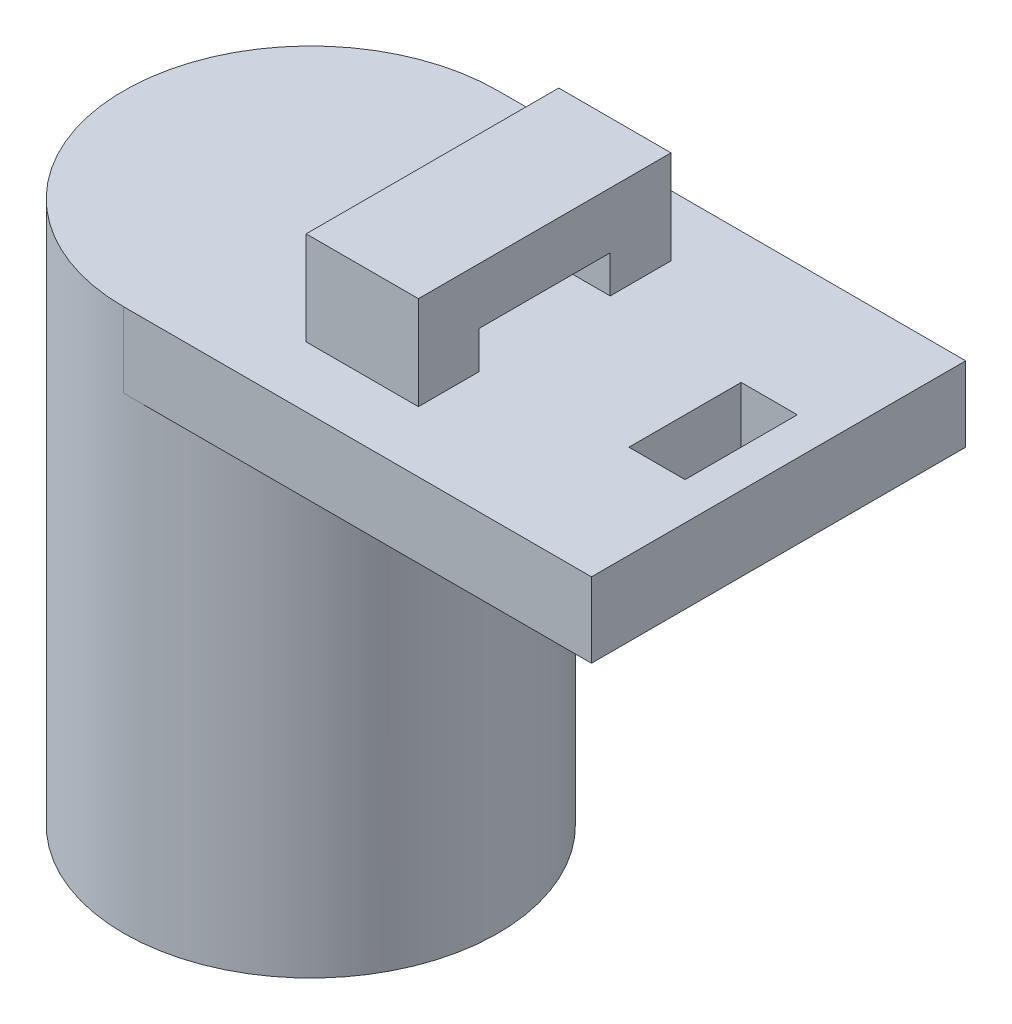
ISO-10303-21;
HEADER;
FILE_DESCRIPTION(('STEP AP214'),'2;1');
FILE_NAME('part.step','',(''),(''),'','','');
FILE_SCHEMA(('AUTOMOTIVE_DESIGN { 1 0 10303 214 1 1 1 1 }'));
ENDSEC;
DATA;
#1=APPLICATION_CONTEXT('core data for automotive mechanical design processes');
#2=APPLICATION_PROTOCOL_DEFINITION('international standard','automotive_design',2000,#1);
#3=PRODUCT_CONTEXT('',#1,'mechanical');
#4=PRODUCT('Part','Part','',(#3));
#5=PRODUCT_RELATED_PRODUCT_CATEGORY('part','',(#4));
#6=PRODUCT_DEFINITION_FORMATION('','',#4);
#7=PRODUCT_DEFINITION_CONTEXT('part definition',#1,'design');
#8=PRODUCT_DEFINITION('design','',#6,#7);
#9=PRODUCT_DEFINITION_SHAPE('','',#8);
#10=(LENGTH_UNIT() NAMED_UNIT(*) SI_UNIT(.MILLI.,.METRE.));
#11=(NAMED_UNIT(*) PLANE_ANGLE_UNIT() SI_UNIT($,.RADIAN.));
#12=(NAMED_UNIT(*) SI_UNIT($,.STERADIAN.) SOLID_ANGLE_UNIT());
#13=UNCERTAINTY_MEASURE_WITH_UNIT(LENGTH_MEASURE(1.E-05),#10,'distance_accuracy_value','');
#14=(GEOMETRIC_REPRESENTATION_CONTEXT(3) GLOBAL_UNCERTAINTY_ASSIGNED_CONTEXT((#13)) GLOBAL_UNIT_ASSIGNED_CONTEXT((#10,
#11,#12)) REPRESENTATION_CONTEXT('',''));
#15=CARTESIAN_POINT('',(0.,0.,0.));
#16=DIRECTION('',(0.,0.,1.));
#17=DIRECTION('',(1.,0.,0.));
#18=AXIS2_PLACEMENT_3D('',#15,#16,#17);
#19=CARTESIAN_POINT('',(0.,29.,0.));
#20=DIRECTION('',(0.,1.,0.));
#21=DIRECTION('',(0.,0.,1.));
#22=AXIS2_PLACEMENT_3D('',#19,#20,#21);
#23=PLANE('',#22);
#24=DIRECTION('',(0.,0.,1.));
#25=VECTOR('',#24,1.);
#26=CARTESIAN_POINT('',(20.,29.,3.));
#27=LINE('',#26,#25);
#28=CARTESIAN_POINT('',(20.,29.,-3.));
#29=VERTEX_POINT('',#28);
#30=CARTESIAN_POINT('',(20.,29.,3.));
#31=VERTEX_POINT('',#30);
#32=EDGE_CURVE('E47',#29,#31,#27,.T.);
#33=ORIENTED_EDGE('',*,*,#32,.F.);
#34=DIRECTION('',(-1.,0.,0.));
#35=VECTOR('',#34,1.);
#36=CARTESIAN_POINT('',(20.,29.,-3.));
#37=LINE('',#36,#35);
#38=CARTESIAN_POINT('',(23.,29.,-3.));
#39=VERTEX_POINT('',#38);
#40=EDGE_CURVE('E163',#39,#29,#37,.T.);
#41=ORIENTED_EDGE('',*,*,#40,.F.);
#42=DIRECTION('',(0.,0.,-1.));
#43=VECTOR('',#42,1.);
#44=CARTESIAN_POINT('',(23.,29.,3.));
#45=LINE('',#44,#43);
#46=CARTESIAN_POINT('',(23.,29.,3.));
#47=VERTEX_POINT('',#46);
#48=EDGE_CURVE('E148',#47,#39,#45,.T.);
#49=ORIENTED_EDGE('',*,*,#48,.F.);
#50=DIRECTION('',(1.,0.,0.));
#51=VECTOR('',#50,1.);
#52=CARTESIAN_POINT('',(20.,29.,3.));
#53=LINE('',#52,#51);
#54=EDGE_CURVE('E157',#31,#47,#53,.T.);
#55=ORIENTED_EDGE('',*,*,#54,.F.);
#56=EDGE_LOOP('',(#33,#41,#49,#55));
#57=FACE_BOUND('',#56,.T.);
#58=DIRECTION('',(0.,0.,1.));
#59=VECTOR('',#58,1.);
#60=CARTESIAN_POINT('',(6.5,29.,-6.75));
#61=LINE('',#60,#59);
#62=CARTESIAN_POINT('',(6.5,29.,3.5));
#63=VERTEX_POINT('',#62);
#64=CARTESIAN_POINT('',(6.5,29.,6.75));
#65=VERTEX_POINT('',#64);
#66=EDGE_CURVE('E198',#63,#65,#61,.T.);
#67=ORIENTED_EDGE('',*,*,#66,.F.);
#68=DIRECTION('',(1.,0.,0.));
#69=VECTOR('',#68,1.);
#70=CARTESIAN_POINT('',(0.499999999999999,29.,3.5));
#71=LINE('',#70,#69);
#72=CARTESIAN_POINT('',(12.5,29.,3.5));
#73=VERTEX_POINT('',#72);
#74=EDGE_CURVE('E180',#63,#73,#71,.T.);
#75=ORIENTED_EDGE('',*,*,#74,.T.);
#76=DIRECTION('',(0.,0.,-1.));
#77=VECTOR('',#76,1.);
#78=CARTESIAN_POINT('',(12.5,29.,-6.75));
#79=LINE('',#78,#77);
#80=CARTESIAN_POINT('',(12.5,29.,6.75));
#81=VERTEX_POINT('',#80);
#82=EDGE_CURVE('E216',#81,#73,#79,.T.);
#83=ORIENTED_EDGE('',*,*,#82,.F.);
#84=DIRECTION('',(1.,0.,0.));
#85=VECTOR('',#84,1.);
#86=CARTESIAN_POINT('',(6.5,29.,6.75));
#87=LINE('',#86,#85);
#88=EDGE_CURVE('E213',#65,#81,#87,.T.);
#89=ORIENTED_EDGE('',*,*,#88,.F.);
#90=EDGE_LOOP('',(#67,#75,#83,#89));
#91=FACE_BOUND('',#90,.T.);
#92=DIRECTION('',(1.,0.,0.));
#93=VECTOR('',#92,1.);
#94=CARTESIAN_POINT('',(0.499999999999999,29.,-3.5));
#95=LINE('',#94,#93);
#96=CARTESIAN_POINT('',(6.5,29.,-3.5));
#97=VERTEX_POINT('',#96);
#98=CARTESIAN_POINT('',(12.5,29.,-3.5));
#99=VERTEX_POINT('',#98);
#100=EDGE_CURVE('E186',#97,#99,#95,.T.);
#101=ORIENTED_EDGE('',*,*,#100,.F.);
#102=CARTESIAN_POINT('',(6.5,29.,-6.75));
#103=VERTEX_POINT('',#102);
#104=EDGE_CURVE('E210',#103,#97,#61,.T.);
#105=ORIENTED_EDGE('',*,*,#104,.F.);
#106=DIRECTION('',(-1.,0.,0.));
#107=VECTOR('',#106,1.);
#108=CARTESIAN_POINT('',(6.5,29.,-6.75));
#109=LINE('',#108,#107);
#110=CARTESIAN_POINT('',(12.5,29.,-6.75));
#111=VERTEX_POINT('',#110);
#112=EDGE_CURVE('E203',#111,#103,#109,.T.);
#113=ORIENTED_EDGE('',*,*,#112,.F.);
#114=EDGE_CURVE('E215',#99,#111,#79,.T.);
#115=ORIENTED_EDGE('',*,*,#114,.F.);
#116=EDGE_LOOP('',(#101,#105,#113,#115));
#117=FACE_BOUND('',#116,.T.);
#118=CARTESIAN_POINT('',(0.,29.,0.));
#119=DIRECTION('',(0.,1.,0.));
#120=DIRECTION('',(0.,0.,1.));
#121=AXIS2_PLACEMENT_3D('',#118,#119,#120);
#122=CIRCLE('',#121,10.);
#123=CARTESIAN_POINT('',(0.,29.,-10.));
#124=VERTEX_POINT('',#123);
#125=CARTESIAN_POINT('',(0.,29.,10.));
#126=VERTEX_POINT('',#125);
#127=EDGE_CURVE('E232',#124,#126,#122,.T.);
#128=ORIENTED_EDGE('',*,*,#127,.T.);
#129=DIRECTION('',(1.,0.,0.));
#130=VECTOR('',#129,1.);
#131=CARTESIAN_POINT('',(0.,29.,10.));
#132=LINE('',#131,#130);
#133=CARTESIAN_POINT('',(25.,29.,10.));
#134=VERTEX_POINT('',#133);
#135=EDGE_CURVE('E235',#126,#134,#132,.T.);
#136=ORIENTED_EDGE('',*,*,#135,.T.);
#137=DIRECTION('',(0.,0.,-1.));
#138=VECTOR('',#137,1.);
#139=CARTESIAN_POINT('',(25.,29.,-10.));
#140=LINE('',#139,#138);
#141=CARTESIAN_POINT('',(25.,29.,-10.));
#142=VERTEX_POINT('',#141);
#143=EDGE_CURVE('E238',#134,#142,#140,.T.);
#144=ORIENTED_EDGE('',*,*,#143,.T.);
#145=DIRECTION('',(-1.,0.,0.));
#146=VECTOR('',#145,1.);
#147=CARTESIAN_POINT('',(0.,29.,-10.));
#148=LINE('',#147,#146);
#149=EDGE_CURVE('E240',#142,#124,#148,.T.);
#150=ORIENTED_EDGE('',*,*,#149,.T.);
#151=EDGE_LOOP('',(#128,#136,#144,#150));
#152=FACE_BOUND('',#151,.T.);
#153=ADVANCED_FACE('F32',(#57,#91,#117,#152),#23,.T.);
#154=CARTESIAN_POINT('',(0.,0.,0.));
#155=DIRECTION('',(0.,1.,0.));
#156=DIRECTION('',(0.,0.,1.));
#157=AXIS2_PLACEMENT_3D('',#154,#155,#156);
#158=PLANE('',#157);
#159=CARTESIAN_POINT('',(0.,0.,0.));
#160=DIRECTION('',(0.,1.,0.));
#161=DIRECTION('',(0.,0.,1.));
#162=AXIS2_PLACEMENT_3D('',#159,#160,#161);
#163=CIRCLE('',#162,10.);
#164=CARTESIAN_POINT('',(0.,0.,10.));
#165=VERTEX_POINT('',#164);
#166=EDGE_CURVE('E265',#165,#165,#163,.T.);
#167=ORIENTED_EDGE('',*,*,#166,.F.);
#168=EDGE_LOOP('',(#167));
#169=FACE_BOUND('',#168,.T.);
#170=CARTESIAN_POINT('',(0.,0.,0.));
#171=DIRECTION('',(0.,1.,0.));
#172=DIRECTION('',(0.,0.,1.));
#173=AXIS2_PLACEMENT_3D('',#170,#171,#172);
#174=CIRCLE('',#173,6.5);
#175=CARTESIAN_POINT('',(0.,0.,6.5));
#176=VERTEX_POINT('',#175);
#177=EDGE_CURVE('E262',#176,#176,#174,.T.);
#178=ORIENTED_EDGE('',*,*,#177,.T.);
#179=EDGE_LOOP('',(#178));
#180=FACE_BOUND('',#179,.T.);
#181=ADVANCED_FACE('F294',(#169,#180),#158,.F.);
#182=CARTESIAN_POINT('',(0.,25.,0.));
#183=DIRECTION('',(0.,-1.,0.));
#184=DIRECTION('',(0.,0.,-1.));
#185=AXIS2_PLACEMENT_3D('',#182,#183,#184);
#186=CYLINDRICAL_SURFACE('',#185,10.);
#187=CARTESIAN_POINT('',(0.,25.,0.));
#188=DIRECTION('',(0.,1.,0.));
#189=DIRECTION('',(0.,0.,1.));
#190=AXIS2_PLACEMENT_3D('',#187,#188,#189);
#191=CIRCLE('',#190,10.);
#192=CARTESIAN_POINT('',(0.,25.,10.));
#193=VERTEX_POINT('',#192);
#194=CARTESIAN_POINT('',(0.,25.,-10.));
#195=VERTEX_POINT('',#194);
#196=EDGE_CURVE('E266',#193,#195,#191,.T.);
#197=ORIENTED_EDGE('',*,*,#196,.F.);
#198=DIRECTION('',(0.,-1.,0.));
#199=VECTOR('',#198,1.);
#200=CARTESIAN_POINT('',(0.,29.,10.));
#201=LINE('',#200,#199);
#202=EDGE_CURVE('E256',#126,#193,#201,.T.);
#203=ORIENTED_EDGE('',*,*,#202,.F.);
#204=ORIENTED_EDGE('',*,*,#127,.F.);
#205=DIRECTION('',(0.,-1.,0.));
#206=VECTOR('',#205,1.);
#207=CARTESIAN_POINT('',(0.,29.,-10.));
#208=LINE('',#207,#206);
#209=EDGE_CURVE('E242',#124,#195,#208,.T.);
#210=ORIENTED_EDGE('',*,*,#209,.T.);
#211=EDGE_LOOP('',(#197,#203,#204,#210));
#212=FACE_BOUND('',#211,.T.);
#213=ORIENTED_EDGE('',*,*,#166,.T.);
#214=EDGE_LOOP('',(#213));
#215=FACE_BOUND('',#214,.T.);
#216=ADVANCED_FACE('F34',(#212,#215),#186,.T.);
#217=CARTESIAN_POINT('',(0.,25.,0.));
#218=DIRECTION('',(0.,-1.,0.));
#219=DIRECTION('',(0.,0.,-1.));
#220=AXIS2_PLACEMENT_3D('',#217,#218,#219);
#221=CYLINDRICAL_SURFACE('',#220,6.5);
#222=CARTESIAN_POINT('',(0.,25.,0.));
#223=DIRECTION('',(0.,1.,0.));
#224=DIRECTION('',(0.,0.,1.));
#225=AXIS2_PLACEMENT_3D('',#222,#223,#224);
#226=CIRCLE('',#225,6.5);
#227=CARTESIAN_POINT('',(0.,25.,6.5));
#228=VERTEX_POINT('',#227);
#229=EDGE_CURVE('E259',#228,#228,#226,.T.);
#230=ORIENTED_EDGE('',*,*,#229,.T.);
#231=EDGE_LOOP('',(#230));
#232=FACE_BOUND('',#231,.T.);
#233=ORIENTED_EDGE('',*,*,#177,.F.);
#234=EDGE_LOOP('',(#233));
#235=FACE_BOUND('',#234,.T.);
#236=ADVANCED_FACE('F307',(#232,#235),#221,.F.);
#237=CARTESIAN_POINT('',(0.,25.,0.));
#238=DIRECTION('',(0.,1.,0.));
#239=DIRECTION('',(0.,0.,1.));
#240=AXIS2_PLACEMENT_3D('',#237,#238,#239);
#241=PLANE('',#240);
#242=ORIENTED_EDGE('',*,*,#229,.F.);
#243=EDGE_LOOP('',(#242));
#244=FACE_BOUND('',#243,.T.);
#245=ADVANCED_FACE('F304',(#244),#241,.F.);
#246=DIRECTION('',(-1.,0.,0.));
#247=VECTOR('',#246,1.);
#248=CARTESIAN_POINT('',(0.,25.,-3.));
#249=LINE('',#248,#247);
#250=CARTESIAN_POINT('',(23.,25.,-3.));
#251=VERTEX_POINT('',#250);
#252=CARTESIAN_POINT('',(20.,25.,-3.));
#253=VERTEX_POINT('',#252);
#254=EDGE_CURVE('E40',#251,#253,#249,.T.);
#255=ORIENTED_EDGE('',*,*,#254,.T.);
#256=DIRECTION('',(0.,0.,1.));
#257=VECTOR('',#256,1.);
#258=CARTESIAN_POINT('',(20.,25.,0.));
#259=LINE('',#258,#257);
#260=CARTESIAN_POINT('',(20.,25.,3.));
#261=VERTEX_POINT('',#260);
#262=EDGE_CURVE('E11',#253,#261,#259,.T.);
#263=ORIENTED_EDGE('',*,*,#262,.T.);
#264=DIRECTION('',(1.,0.,0.));
#265=VECTOR('',#264,1.);
#266=CARTESIAN_POINT('',(0.,25.,3.));
#267=LINE('',#266,#265);
#268=CARTESIAN_POINT('',(23.,25.,3.));
#269=VERTEX_POINT('',#268);
#270=EDGE_CURVE('E268',#261,#269,#267,.T.);
#271=ORIENTED_EDGE('',*,*,#270,.T.);
#272=DIRECTION('',(0.,0.,-1.));
#273=VECTOR('',#272,1.);
#274=CARTESIAN_POINT('',(23.,25.,0.));
#275=LINE('',#274,#273);
#276=EDGE_CURVE('E151',#269,#251,#275,.T.);
#277=ORIENTED_EDGE('',*,*,#276,.T.);
#278=EDGE_LOOP('',(#255,#263,#271,#277));
#279=FACE_BOUND('',#278,.T.);
#280=DIRECTION('',(1.,0.,0.));
#281=VECTOR('',#280,1.);
#282=CARTESIAN_POINT('',(0.,25.,10.));
#283=LINE('',#282,#281);
#284=CARTESIAN_POINT('',(25.,25.,10.));
#285=VERTEX_POINT('',#284);
#286=EDGE_CURVE('E231',#193,#285,#283,.T.);
#287=ORIENTED_EDGE('',*,*,#286,.F.);
#288=ORIENTED_EDGE('',*,*,#196,.T.);
#289=DIRECTION('',(-1.,0.,0.));
#290=VECTOR('',#289,1.);
#291=CARTESIAN_POINT('',(0.,25.,-10.));
#292=LINE('',#291,#290);
#293=CARTESIAN_POINT('',(25.,25.,-10.));
#294=VERTEX_POINT('',#293);
#295=EDGE_CURVE('E236',#294,#195,#292,.T.);
#296=ORIENTED_EDGE('',*,*,#295,.F.);
#297=DIRECTION('',(0.,0.,-1.));
#298=VECTOR('',#297,1.);
#299=CARTESIAN_POINT('',(25.,25.,-10.));
#300=LINE('',#299,#298);
#301=EDGE_CURVE('E244',#285,#294,#300,.T.);
#302=ORIENTED_EDGE('',*,*,#301,.F.);
#303=EDGE_LOOP('',(#287,#288,#296,#302));
#304=FACE_BOUND('',#303,.T.);
#305=ADVANCED_FACE('F274',(#279,#304),#241,.F.);
#306=CARTESIAN_POINT('',(0.,29.,10.));
#307=DIRECTION('',(0.,0.,-1.));
#308=DIRECTION('',(-1.,0.,0.));
#309=AXIS2_PLACEMENT_3D('',#306,#307,#308);
#310=PLANE('',#309);
#311=ORIENTED_EDGE('',*,*,#286,.T.);
#312=DIRECTION('',(0.,-1.,0.));
#313=VECTOR('',#312,1.);
#314=CARTESIAN_POINT('',(25.,29.,10.));
#315=LINE('',#314,#313);
#316=EDGE_CURVE('E253',#134,#285,#315,.T.);
#317=ORIENTED_EDGE('',*,*,#316,.F.);
#318=ORIENTED_EDGE('',*,*,#135,.F.);
#319=ORIENTED_EDGE('',*,*,#202,.T.);
#320=EDGE_LOOP('',(#311,#317,#318,#319));
#321=FACE_BOUND('',#320,.T.);
#322=ADVANCED_FACE('F316',(#321),#310,.F.);
#323=CARTESIAN_POINT('',(25.,29.,-10.));
#324=DIRECTION('',(-1.,0.,0.));
#325=DIRECTION('',(0.,0.,1.));
#326=AXIS2_PLACEMENT_3D('',#323,#324,#325);
#327=PLANE('',#326);
#328=ORIENTED_EDGE('',*,*,#301,.T.);
#329=DIRECTION('',(0.,-1.,0.));
#330=VECTOR('',#329,1.);
#331=CARTESIAN_POINT('',(25.,29.,-10.));
#332=LINE('',#331,#330);
#333=EDGE_CURVE('E250',#142,#294,#332,.T.);
#334=ORIENTED_EDGE('',*,*,#333,.F.);
#335=ORIENTED_EDGE('',*,*,#143,.F.);
#336=ORIENTED_EDGE('',*,*,#316,.T.);
#337=EDGE_LOOP('',(#328,#334,#335,#336));
#338=FACE_BOUND('',#337,.T.);
#339=ADVANCED_FACE('F312',(#338),#327,.F.);
#340=CARTESIAN_POINT('',(0.,29.,-10.));
#341=DIRECTION('',(0.,0.,1.));
#342=DIRECTION('',(1.,0.,0.));
#343=AXIS2_PLACEMENT_3D('',#340,#341,#342);
#344=PLANE('',#343);
#345=ORIENTED_EDGE('',*,*,#295,.T.);
#346=ORIENTED_EDGE('',*,*,#209,.F.);
#347=ORIENTED_EDGE('',*,*,#149,.F.);
#348=ORIENTED_EDGE('',*,*,#333,.T.);
#349=EDGE_LOOP('',(#345,#346,#347,#348));
#350=FACE_BOUND('',#349,.T.);
#351=ADVANCED_FACE('F309',(#350),#344,.F.);
#352=CARTESIAN_POINT('',(6.5,34.,-6.75));
#353=DIRECTION('',(1.,0.,0.));
#354=DIRECTION('',(0.,0.,-1.));
#355=AXIS2_PLACEMENT_3D('',#352,#353,#354);
#356=PLANE('',#355);
#357=DIRECTION('',(0.,0.,1.));
#358=VECTOR('',#357,1.);
#359=CARTESIAN_POINT('',(6.5,31.,-6.75));
#360=LINE('',#359,#358);
#361=CARTESIAN_POINT('',(6.5,31.,-3.5));
#362=VERTEX_POINT('',#361);
#363=CARTESIAN_POINT('',(6.5,31.,3.5));
#364=VERTEX_POINT('',#363);
#365=EDGE_CURVE('E192',#362,#364,#360,.T.);
#366=ORIENTED_EDGE('',*,*,#365,.T.);
#367=DIRECTION('',(0.,-1.,0.));
#368=VECTOR('',#367,1.);
#369=CARTESIAN_POINT('',(6.5,34.,3.5));
#370=LINE('',#369,#368);
#371=EDGE_CURVE('E195',#364,#63,#370,.T.);
#372=ORIENTED_EDGE('',*,*,#371,.T.);
#373=ORIENTED_EDGE('',*,*,#66,.T.);
#374=DIRECTION('',(0.,-1.,0.));
#375=VECTOR('',#374,1.);
#376=CARTESIAN_POINT('',(6.5,34.,6.75));
#377=LINE('',#376,#375);
#378=CARTESIAN_POINT('',(6.5,34.,6.75));
#379=VERTEX_POINT('',#378);
#380=EDGE_CURVE('E228',#379,#65,#377,.T.);
#381=ORIENTED_EDGE('',*,*,#380,.F.);
#382=DIRECTION('',(0.,0.,1.));
#383=VECTOR('',#382,1.);
#384=CARTESIAN_POINT('',(6.5,34.,-6.75));
#385=LINE('',#384,#383);
#386=CARTESIAN_POINT('',(6.5,34.,-6.75));
#387=VERTEX_POINT('',#386);
#388=EDGE_CURVE('E199',#387,#379,#385,.T.);
#389=ORIENTED_EDGE('',*,*,#388,.F.);
#390=DIRECTION('',(0.,-1.,0.));
#391=VECTOR('',#390,1.);
#392=CARTESIAN_POINT('',(6.5,34.,-6.75));
#393=LINE('',#392,#391);
#394=EDGE_CURVE('E209',#387,#103,#393,.T.);
#395=ORIENTED_EDGE('',*,*,#394,.T.);
#396=ORIENTED_EDGE('',*,*,#104,.T.);
#397=DIRECTION('',(0.,1.,0.));
#398=VECTOR('',#397,1.);
#399=CARTESIAN_POINT('',(6.5,34.,-3.5));
#400=LINE('',#399,#398);
#401=EDGE_CURVE('E183',#97,#362,#400,.T.);
#402=ORIENTED_EDGE('',*,*,#401,.T.);
#403=EDGE_LOOP('',(#366,#372,#373,#381,#389,#395,#396,#402));
#404=FACE_BOUND('',#403,.T.);
#405=ADVANCED_FACE('F302',(#404),#356,.F.);
#406=CARTESIAN_POINT('',(6.5,34.,6.75));
#407=DIRECTION('',(0.,0.,-1.));
#408=DIRECTION('',(-1.,0.,0.));
#409=AXIS2_PLACEMENT_3D('',#406,#407,#408);
#410=PLANE('',#409);
#411=ORIENTED_EDGE('',*,*,#88,.T.);
#412=DIRECTION('',(0.,-1.,0.));
#413=VECTOR('',#412,1.);
#414=CARTESIAN_POINT('',(12.5,34.,6.75));
#415=LINE('',#414,#413);
#416=CARTESIAN_POINT('',(12.5,34.,6.75));
#417=VERTEX_POINT('',#416);
#418=EDGE_CURVE('E225',#417,#81,#415,.T.);
#419=ORIENTED_EDGE('',*,*,#418,.F.);
#420=DIRECTION('',(1.,0.,0.));
#421=VECTOR('',#420,1.);
#422=CARTESIAN_POINT('',(6.5,34.,6.75));
#423=LINE('',#422,#421);
#424=EDGE_CURVE('E202',#379,#417,#423,.T.);
#425=ORIENTED_EDGE('',*,*,#424,.F.);
#426=ORIENTED_EDGE('',*,*,#380,.T.);
#427=EDGE_LOOP('',(#411,#419,#425,#426));
#428=FACE_BOUND('',#427,.T.);
#429=ADVANCED_FACE('F370',(#428),#410,.F.);
#430=CARTESIAN_POINT('',(12.5,34.,-6.75));
#431=DIRECTION('',(-1.,0.,0.));
#432=DIRECTION('',(0.,0.,1.));
#433=AXIS2_PLACEMENT_3D('',#430,#431,#432);
#434=PLANE('',#433);
#435=ORIENTED_EDGE('',*,*,#82,.T.);
#436=DIRECTION('',(0.,-1.,0.));
#437=VECTOR('',#436,1.);
#438=CARTESIAN_POINT('',(12.5,31.,3.5));
#439=LINE('',#438,#437);
#440=CARTESIAN_POINT('',(12.5,31.,3.5));
#441=VERTEX_POINT('',#440);
#442=EDGE_CURVE('E170',#441,#73,#439,.T.);
#443=ORIENTED_EDGE('',*,*,#442,.F.);
#444=DIRECTION('',(0.,0.,1.));
#445=VECTOR('',#444,1.);
#446=CARTESIAN_POINT('',(12.5,31.,3.5));
#447=LINE('',#446,#445);
#448=CARTESIAN_POINT('',(12.5,31.,-3.5));
#449=VERTEX_POINT('',#448);
#450=EDGE_CURVE('E177',#449,#441,#447,.T.);
#451=ORIENTED_EDGE('',*,*,#450,.F.);
#452=DIRECTION('',(0.,1.,0.));
#453=VECTOR('',#452,1.);
#454=CARTESIAN_POINT('',(12.5,31.,-3.5));
#455=LINE('',#454,#453);
#456=EDGE_CURVE('E174',#99,#449,#455,.T.);
#457=ORIENTED_EDGE('',*,*,#456,.F.);
#458=ORIENTED_EDGE('',*,*,#114,.T.);
#459=DIRECTION('',(0.,-1.,0.));
#460=VECTOR('',#459,1.);
#461=CARTESIAN_POINT('',(12.5,34.,-6.75));
#462=LINE('',#461,#460);
#463=CARTESIAN_POINT('',(12.5,34.,-6.75));
#464=VERTEX_POINT('',#463);
#465=EDGE_CURVE('E222',#464,#111,#462,.T.);
#466=ORIENTED_EDGE('',*,*,#465,.F.);
#467=DIRECTION('',(0.,0.,-1.));
#468=VECTOR('',#467,1.);
#469=CARTESIAN_POINT('',(12.5,34.,-6.75));
#470=LINE('',#469,#468);
#471=EDGE_CURVE('E205',#417,#464,#470,.T.);
#472=ORIENTED_EDGE('',*,*,#471,.F.);
#473=ORIENTED_EDGE('',*,*,#418,.T.);
#474=EDGE_LOOP('',(#435,#443,#451,#457,#458,#466,#472,#473));
#475=FACE_BOUND('',#474,.T.);
#476=ADVANCED_FACE('F378',(#475),#434,.F.);
#477=CARTESIAN_POINT('',(6.5,34.,-6.75));
#478=DIRECTION('',(0.,0.,1.));
#479=DIRECTION('',(1.,0.,0.));
#480=AXIS2_PLACEMENT_3D('',#477,#478,#479);
#481=PLANE('',#480);
#482=ORIENTED_EDGE('',*,*,#112,.T.);
#483=ORIENTED_EDGE('',*,*,#394,.F.);
#484=DIRECTION('',(-1.,0.,0.));
#485=VECTOR('',#484,1.);
#486=CARTESIAN_POINT('',(6.5,34.,-6.75));
#487=LINE('',#486,#485);
#488=EDGE_CURVE('E207',#464,#387,#487,.T.);
#489=ORIENTED_EDGE('',*,*,#488,.F.);
#490=ORIENTED_EDGE('',*,*,#465,.T.);
#491=EDGE_LOOP('',(#482,#483,#489,#490));
#492=FACE_BOUND('',#491,.T.);
#493=ADVANCED_FACE('F385',(#492),#481,.F.);
#494=CARTESIAN_POINT('',(0.,34.,0.));
#495=DIRECTION('',(0.,1.,0.));
#496=DIRECTION('',(0.,0.,1.));
#497=AXIS2_PLACEMENT_3D('',#494,#495,#496);
#498=PLANE('',#497);
#499=ORIENTED_EDGE('',*,*,#388,.T.);
#500=ORIENTED_EDGE('',*,*,#424,.T.);
#501=ORIENTED_EDGE('',*,*,#471,.T.);
#502=ORIENTED_EDGE('',*,*,#488,.T.);
#503=EDGE_LOOP('',(#499,#500,#501,#502));
#504=FACE_BOUND('',#503,.T.);
#505=ADVANCED_FACE('F393',(#504),#498,.T.);
#506=CARTESIAN_POINT('',(0.499999999999999,31.,3.5));
#507=DIRECTION('',(0.,0.,1.));
#508=DIRECTION('',(0.,-1.,0.));
#509=AXIS2_PLACEMENT_3D('',#506,#507,#508);
#510=PLANE('',#509);
#511=DIRECTION('',(1.,0.,0.));
#512=VECTOR('',#511,1.);
#513=CARTESIAN_POINT('',(0.499999999999999,31.,3.5));
#514=LINE('',#513,#512);
#515=EDGE_CURVE('E181',#364,#441,#514,.T.);
#516=ORIENTED_EDGE('',*,*,#515,.T.);
#517=ORIENTED_EDGE('',*,*,#442,.T.);
#518=ORIENTED_EDGE('',*,*,#74,.F.);
#519=ORIENTED_EDGE('',*,*,#371,.F.);
#520=EDGE_LOOP('',(#516,#517,#518,#519));
#521=FACE_BOUND('',#520,.T.);
#522=ADVANCED_FACE('F400',(#521),#510,.F.);
#523=CARTESIAN_POINT('',(0.499999999999999,31.,3.5));
#524=DIRECTION('',(0.,1.,0.));
#525=DIRECTION('',(0.,0.,1.));
#526=AXIS2_PLACEMENT_3D('',#523,#524,#525);
#527=PLANE('',#526);
#528=DIRECTION('',(1.,0.,0.));
#529=VECTOR('',#528,1.);
#530=CARTESIAN_POINT('',(0.499999999999999,31.,-3.5));
#531=LINE('',#530,#529);
#532=EDGE_CURVE('E184',#362,#449,#531,.T.);
#533=ORIENTED_EDGE('',*,*,#532,.T.);
#534=ORIENTED_EDGE('',*,*,#450,.T.);
#535=ORIENTED_EDGE('',*,*,#515,.F.);
#536=ORIENTED_EDGE('',*,*,#365,.F.);
#537=EDGE_LOOP('',(#533,#534,#535,#536));
#538=FACE_BOUND('',#537,.T.);
#539=ADVANCED_FACE('F288',(#538),#527,.F.);
#540=CARTESIAN_POINT('',(0.499999999999999,31.,-3.5));
#541=DIRECTION('',(0.,0.,-1.));
#542=DIRECTION('',(0.,1.,0.));
#543=AXIS2_PLACEMENT_3D('',#540,#541,#542);
#544=PLANE('',#543);
#545=ORIENTED_EDGE('',*,*,#100,.T.);
#546=ORIENTED_EDGE('',*,*,#456,.T.);
#547=ORIENTED_EDGE('',*,*,#532,.F.);
#548=ORIENTED_EDGE('',*,*,#401,.F.);
#549=EDGE_LOOP('',(#545,#546,#547,#548));
#550=FACE_BOUND('',#549,.T.);
#551=ADVANCED_FACE('F281',(#550),#544,.F.);
#552=CARTESIAN_POINT('',(20.,17.,3.));
#553=DIRECTION('',(-1.,0.,0.));
#554=DIRECTION('',(0.,0.,1.));
#555=AXIS2_PLACEMENT_3D('',#552,#553,#554);
#556=PLANE('',#555);
#557=DIRECTION('',(0.,1.,0.));
#558=VECTOR('',#557,1.);
#559=CARTESIAN_POINT('',(20.,17.,-3.));
#560=LINE('',#559,#558);
#561=EDGE_CURVE('E168',#253,#29,#560,.T.);
#562=ORIENTED_EDGE('',*,*,#561,.T.);
#563=ORIENTED_EDGE('',*,*,#32,.T.);
#564=DIRECTION('',(0.,1.,0.));
#565=VECTOR('',#564,1.);
#566=CARTESIAN_POINT('',(20.,17.,3.));
#567=LINE('',#566,#565);
#568=EDGE_CURVE('E154',#261,#31,#567,.T.);
#569=ORIENTED_EDGE('',*,*,#568,.F.);
#570=ORIENTED_EDGE('',*,*,#262,.F.);
#571=EDGE_LOOP('',(#562,#563,#569,#570));
#572=FACE_BOUND('',#571,.T.);
#573=ADVANCED_FACE('F279',(#572),#556,.F.);
#574=CARTESIAN_POINT('',(20.,17.,-3.));
#575=DIRECTION('',(0.,0.,-1.));
#576=DIRECTION('',(-1.,0.,0.));
#577=AXIS2_PLACEMENT_3D('',#574,#575,#576);
#578=PLANE('',#577);
#579=DIRECTION('',(0.,1.,0.));
#580=VECTOR('',#579,1.);
#581=CARTESIAN_POINT('',(23.,17.,-3.));
#582=LINE('',#581,#580);
#583=EDGE_CURVE('E153',#251,#39,#582,.T.);
#584=ORIENTED_EDGE('',*,*,#583,.T.);
#585=ORIENTED_EDGE('',*,*,#40,.T.);
#586=ORIENTED_EDGE('',*,*,#561,.F.);
#587=ORIENTED_EDGE('',*,*,#254,.F.);
#588=EDGE_LOOP('',(#584,#585,#586,#587));
#589=FACE_BOUND('',#588,.T.);
#590=ADVANCED_FACE('F278',(#589),#578,.F.);
#591=CARTESIAN_POINT('',(23.,17.,3.));
#592=DIRECTION('',(1.,0.,0.));
#593=DIRECTION('',(0.,0.,-1.));
#594=AXIS2_PLACEMENT_3D('',#591,#592,#593);
#595=PLANE('',#594);
#596=DIRECTION('',(0.,1.,0.));
#597=VECTOR('',#596,1.);
#598=CARTESIAN_POINT('',(23.,17.,3.));
#599=LINE('',#598,#597);
#600=EDGE_CURVE('E55',#269,#47,#599,.T.);
#601=ORIENTED_EDGE('',*,*,#600,.T.);
#602=ORIENTED_EDGE('',*,*,#48,.T.);
#603=ORIENTED_EDGE('',*,*,#583,.F.);
#604=ORIENTED_EDGE('',*,*,#276,.F.);
#605=EDGE_LOOP('',(#601,#602,#603,#604));
#606=FACE_BOUND('',#605,.T.);
#607=ADVANCED_FACE('F145',(#606),#595,.F.);
#608=CARTESIAN_POINT('',(20.,17.,3.));
#609=DIRECTION('',(0.,0.,1.));
#610=DIRECTION('',(1.,0.,0.));
#611=AXIS2_PLACEMENT_3D('',#608,#609,#610);
#612=PLANE('',#611);
#613=ORIENTED_EDGE('',*,*,#568,.T.);
#614=ORIENTED_EDGE('',*,*,#54,.T.);
#615=ORIENTED_EDGE('',*,*,#600,.F.);
#616=ORIENTED_EDGE('',*,*,#270,.F.);
#617=EDGE_LOOP('',(#613,#614,#615,#616));
#618=FACE_BOUND('',#617,.T.);
#619=ADVANCED_FACE('F158',(#618),#612,.F.);
#620=CLOSED_SHELL('',(#153,#181,#216,#236,#245,#305,#322,#339,#351,#405,#429,#476,#493,#505,
#522,#539,#551,#573,#590,#607,#619));
#621=MANIFOLD_SOLID_BREP('B2',#620);
#622=ADVANCED_BREP_SHAPE_REPRESENTATION('',(#18,#621),#14);
#623=SHAPE_DEFINITION_REPRESENTATION(#9,#622);
ENDSEC;
END-ISO-10303-21;
